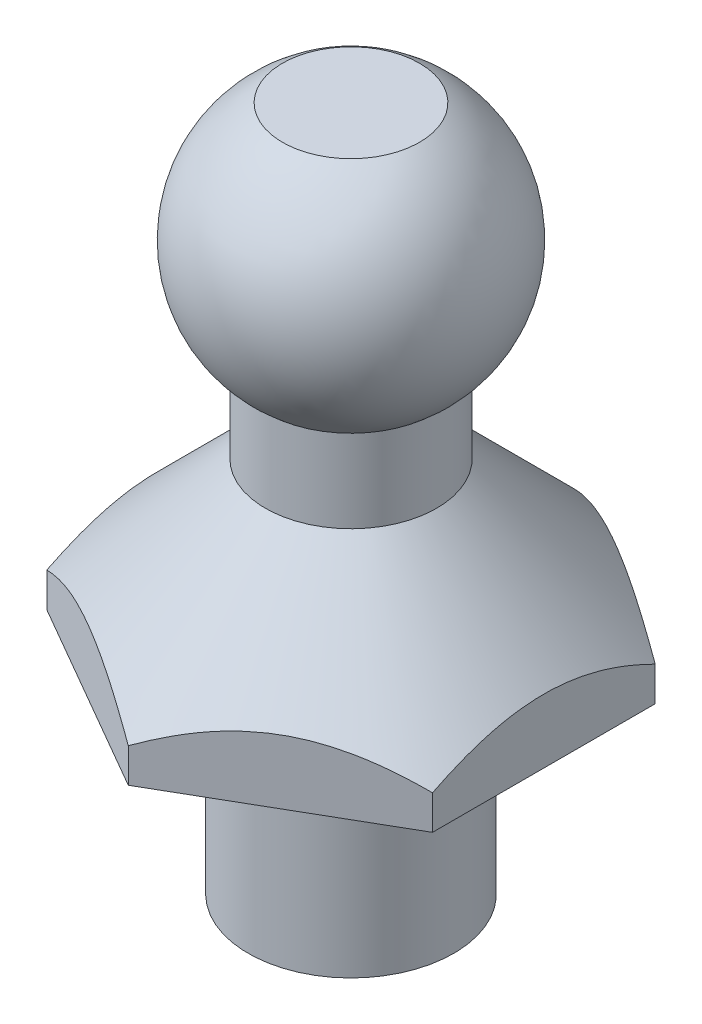
ISO-10303-21;
HEADER;
FILE_DESCRIPTION(('STEP AP214'),'2;1');
FILE_NAME('part.step','',(''),(''),'','','');
FILE_SCHEMA(('AUTOMOTIVE_DESIGN { 1 0 10303 214 1 1 1 1 }'));
ENDSEC;
DATA;
#1=APPLICATION_CONTEXT('core data for automotive mechanical design processes');
#2=APPLICATION_PROTOCOL_DEFINITION('international standard','automotive_design',2000,#1);
#3=PRODUCT_CONTEXT('',#1,'mechanical');
#4=PRODUCT('Part','Part','',(#3));
#5=PRODUCT_RELATED_PRODUCT_CATEGORY('part','',(#4));
#6=PRODUCT_DEFINITION_FORMATION('','',#4);
#7=PRODUCT_DEFINITION_CONTEXT('part definition',#1,'design');
#8=PRODUCT_DEFINITION('design','',#6,#7);
#9=PRODUCT_DEFINITION_SHAPE('','',#8);
#10=(LENGTH_UNIT() NAMED_UNIT(*) SI_UNIT(.MILLI.,.METRE.));
#11=(NAMED_UNIT(*) PLANE_ANGLE_UNIT() SI_UNIT($,.RADIAN.));
#12=(NAMED_UNIT(*) SI_UNIT($,.STERADIAN.) SOLID_ANGLE_UNIT());
#13=UNCERTAINTY_MEASURE_WITH_UNIT(LENGTH_MEASURE(1.E-05),#10,'distance_accuracy_value','');
#14=(GEOMETRIC_REPRESENTATION_CONTEXT(3) GLOBAL_UNCERTAINTY_ASSIGNED_CONTEXT((#13)) GLOBAL_UNIT_ASSIGNED_CONTEXT((#10,
#11,#12)) REPRESENTATION_CONTEXT('',''));
#15=CARTESIAN_POINT('',(0.,0.,0.));
#16=DIRECTION('',(0.,0.,1.));
#17=DIRECTION('',(1.,0.,0.));
#18=AXIS2_PLACEMENT_3D('',#15,#16,#17);
#19=CARTESIAN_POINT('',(0.,5.49999999999999,0.));
#20=DIRECTION('',(0.,-1.,0.));
#21=DIRECTION('',(0.,0.,-1.));
#22=AXIS2_PLACEMENT_3D('',#19,#20,#21);
#23=CONICAL_SURFACE('',#22,1.25,0.78539816339745);
#24=CARTESIAN_POINT('',(0.,5.49999999999999,0.));
#25=DIRECTION('',(0.,-1.,0.));
#26=DIRECTION('',(0.,0.,-1.));
#27=AXIS2_PLACEMENT_3D('',#24,#25,#26);
#28=CIRCLE('',#27,1.25);
#29=CARTESIAN_POINT('',(0.,5.49999999999999,-1.25));
#30=VERTEX_POINT('',#29);
#31=EDGE_CURVE('E135',#30,#30,#28,.T.);
#32=ORIENTED_EDGE('',*,*,#31,.T.);
#33=EDGE_LOOP('',(#32));
#34=FACE_BOUND('',#33,.T.);
#35=CARTESIAN_POINT('',(2.81478256229943,3.49988452379254,1.62488452994616));
#36=CARTESIAN_POINT('',(2.71803192840339,3.55569582125851,1.6807435344703));
#37=CARTESIAN_POINT('',(2.61966349999207,3.60822922894308,1.73753657309334));
#38=CARTESIAN_POINT('',(2.41907947271523,3.70441662600486,1.85334381523677));
#39=CARTESIAN_POINT('',(2.3168447981255,3.74801709742283,1.91236903213166));
#40=CARTESIAN_POINT('',(2.11069346128859,3.82270554280027,2.03139056194825));
#41=CARTESIAN_POINT('',(2.0068292995441,3.85398124190326,2.09135656369059));
#42=CARTESIAN_POINT('',(1.79681445265463,3.9021679296771,2.21260869207604));
#43=CARTESIAN_POINT('',(1.69067018302027,3.91911488792433,2.27389111472237));
#44=CARTESIAN_POINT('',(1.5077355925969,3.93440544734245,2.3795084497474));
#45=CARTESIAN_POINT('',(1.43118159824734,3.93666890950941,2.42370691899266));
#46=CARTESIAN_POINT('',(1.27819875489086,3.93285538424397,2.51203160478592));
#47=CARTESIAN_POINT('',(1.20176995915915,3.92677547287525,2.55615779057546));
#48=CARTESIAN_POINT('',(1.04963404318791,3.906621185951,2.64399350261487));
#49=CARTESIAN_POINT('',(0.973927826701759,3.89253786775703,2.68770250708247));
#50=CARTESIAN_POINT('',(0.823824540503675,3.8571498339076,2.77436467977518));
#51=CARTESIAN_POINT('',(0.749427370886975,3.83584567187425,2.81731790568033));
#52=CARTESIAN_POINT('',(0.558869296387395,3.7726013070244,2.92733666128892));
#53=CARTESIAN_POINT('',(0.443889803642777,3.7258944568754,2.99372010237631));
#54=CARTESIAN_POINT('',(0.274822400733115,3.64704715528485,3.0913312129574));
#55=CARTESIAN_POINT('',(0.219107121059345,3.61934388178491,3.12349844467502));
#56=CARTESIAN_POINT('',(0.108708552582559,3.56141201350278,3.18723708790324));
#57=CARTESIAN_POINT('',(0.0540246552704138,3.53118496874853,3.21880885073675));
#58=CARTESIAN_POINT('',(-0.000199999999999967,3.49988452379254,3.25011547005384));
#59=B_SPLINE_CURVE_WITH_KNOTS('',3,(#35,#36,#37,#38,#39,#40,#41,#42,#43,#44,#45,#46,#47,#48,#49,
#50,#51,#52,#53,#54,#55,#56,#57,#58),.UNSPECIFIED.,.F.,.F.,(4,2,2,2,2,2,2,2,2,2,2,4),(0.,
0.37490911686215,0.752002587144273,1.1231070809152,1.49327719799526,1.75817947462607,
2.0231746100049,2.28846642256626,2.55373789980351,2.97508242886091,3.18518339689877,
3.39515626298431),.UNSPECIFIED.);
#60=CARTESIAN_POINT('',(2.81458256229943,3.5,1.625));
#61=VERTEX_POINT('',#60);
#62=CARTESIAN_POINT('',(0.,3.5,3.25));
#63=VERTEX_POINT('',#62);
#64=EDGE_CURVE('E12',#61,#63,#59,.T.);
#65=ORIENTED_EDGE('',*,*,#64,.F.);
#66=CARTESIAN_POINT('',(2.81458256229943,2.51264677494492,-3.16753648027686));
#67=CARTESIAN_POINT('',(2.81458256229943,2.57054123027341,-3.09007080997921));
#68=CARTESIAN_POINT('',(2.81458256229943,2.62785431234928,-3.01216333514548));
#69=CARTESIAN_POINT('',(2.81458256229943,2.74106013780015,-2.85529371540969));
#70=CARTESIAN_POINT('',(2.81458256229943,2.79695251012891,-2.77633130304017));
#71=CARTESIAN_POINT('',(2.81458256229943,2.90745591854447,-2.61660370945998));
#72=CARTESIAN_POINT('',(2.81458256229943,2.96205365687216,-2.53582929667855));
#73=CARTESIAN_POINT('',(2.81458256229943,3.06913809562125,-2.37289728346604));
#74=CARTESIAN_POINT('',(2.81458256229943,3.12162494739351,-2.2907397828039));
#75=CARTESIAN_POINT('',(2.81458256229943,3.22679579443476,-2.12033702391546));
#76=CARTESIAN_POINT('',(2.81458256229943,3.27933665413556,-2.03200297047045));
#77=CARTESIAN_POINT('',(2.81458256229943,3.38085906326514,-1.85327985390826));
#78=CARTESIAN_POINT('',(2.81458256229943,3.42983999624399,-1.76289043841797));
#79=CARTESIAN_POINT('',(2.81458256229943,3.52317465721835,-1.58008984668445));
#80=CARTESIAN_POINT('',(2.81458256229943,3.56754230020514,-1.48768583125613));
#81=CARTESIAN_POINT('',(2.81458256229943,3.65066721883983,-1.30039444907879));
#82=CARTESIAN_POINT('',(2.81458256229943,3.68942628249785,-1.20550788520535));
#83=CARTESIAN_POINT('',(2.81458256229943,3.75746340028562,-1.01995509098646));
#84=CARTESIAN_POINT('',(2.81458256229943,3.78721838125317,-0.929465593053946));
#85=CARTESIAN_POINT('',(2.81458256229943,3.83945783931224,-0.746372174233533));
#86=CARTESIAN_POINT('',(2.81458256229943,3.86194179433601,-0.653768102027701));
#87=CARTESIAN_POINT('',(2.81458256229943,3.89811115527726,-0.468504136095879));
#88=CARTESIAN_POINT('',(2.81458256229943,3.91194293678274,-0.375873286506929));
#89=CARTESIAN_POINT('',(2.81458256229943,3.9305509613811,-0.189701903234011));
#90=CARTESIAN_POINT('',(2.81458256229943,3.93532861799637,-0.0961615138389461));
#91=CARTESIAN_POINT('',(2.81458256229943,3.93550094302556,0.0878509959341532));
#92=CARTESIAN_POINT('',(2.81458256229943,3.93119870494715,0.178322961294924));
#93=CARTESIAN_POINT('',(2.81458256229943,3.91410137130974,0.358455604496339));
#94=CARTESIAN_POINT('',(2.81458256229943,3.90130542817826,0.448116200466636));
#95=CARTESIAN_POINT('',(2.81458256229943,3.86768849398834,0.627492078676932));
#96=CARTESIAN_POINT('',(2.81458256229943,3.84673340989135,0.71718183709899));
#97=CARTESIAN_POINT('',(2.81458256229943,3.79789377205659,0.894615557814927));
#98=CARTESIAN_POINT('',(2.81458256229943,3.77000988531894,0.982359706517548));
#99=CARTESIAN_POINT('',(2.81458256229943,3.70495314029016,1.16558254819238));
#100=CARTESIAN_POINT('',(2.81458256229943,3.66708607829135,1.26081240499303));
#101=CARTESIAN_POINT('',(2.81458256229943,3.58556742398726,1.44877026883071));
#102=CARTESIAN_POINT('',(2.81458256229943,3.5419138456288,1.54149740366992));
#103=CARTESIAN_POINT('',(2.81458256229943,3.449855682529,1.72493244319764));
#104=CARTESIAN_POINT('',(2.81458256229943,3.4014356818424,1.81563254877077));
#105=CARTESIAN_POINT('',(2.81458256229943,3.300921480241,1.99493803227013));
#106=CARTESIAN_POINT('',(2.81458256229943,3.24882795092564,2.08354378915348));
#107=CARTESIAN_POINT('',(2.81458256229943,3.144373293122,2.25455497118408));
#108=CARTESIAN_POINT('',(2.81458256229943,3.09215606651896,2.33704875841452));
#109=CARTESIAN_POINT('',(2.81458256229943,2.98554318422816,2.50062097121678));
#110=CARTESIAN_POINT('',(2.81458256229943,2.93114736265696,2.5816992883338));
#111=CARTESIAN_POINT('',(2.81458256229943,2.82102043138256,2.74196524042833));
#112=CARTESIAN_POINT('',(2.81458256229943,2.76530387989422,2.82116291497638));
#113=CARTESIAN_POINT('',(2.81458256229943,2.65241034483571,2.97847874431147));
#114=CARTESIAN_POINT('',(2.81458256229943,2.59523376625015,3.05659718938805));
#115=CARTESIAN_POINT('',(2.81458256229943,2.5374607194109,3.1342642183623));
#116=B_SPLINE_CURVE_WITH_KNOTS('',3,(#66,#67,#68,#69,#70,#71,#72,#73,#74,#75,#76,#77,#78,#79,
#80,#81,#82,#83,#84,#85,#86,#87,#88,#89,#90,#91,#92,#93,#94,#95,#96,#97,#98,#99,#100,#101,#102,
#103,#104,#105,#106,#107,#108,#109,#110,#111,#112,#113,#114,#115),.UNSPECIFIED.,.F.,.F.,(4,2,2,
2,2,2,2,2,2,2,2,2,2,2,2,2,2,2,2,2,2,2,2,2,4),(0.,0.290133996791204,0.580343005007957,
0.872802533812616,1.16524105570942,1.47351020690384,1.7818326125537,2.08919626874498,
2.39646172077157,2.68197611864997,2.96751101223076,3.24807446129522,3.52859410541964,
3.79989812178864,4.07122921519798,4.3472217577803,4.62318774226909,4.93039334925607,
5.23770466995732,5.54604479268778,5.85432868968009,6.14718218331588,6.44005801807253,
6.73053868093105,7.02093962677184),.UNSPECIFIED.);
#117=CARTESIAN_POINT('',(2.81458256229943,3.5,-1.625));
#118=VERTEX_POINT('',#117);
#119=EDGE_CURVE('E50',#118,#61,#116,.T.);
#120=ORIENTED_EDGE('',*,*,#119,.F.);
#121=CARTESIAN_POINT('',(-0.000199999999999566,3.49988452379254,-3.25011547005384));
#122=CARTESIAN_POINT('',(0.0965506338960343,3.55569582125851,-3.19425646552969));
#123=CARTESIAN_POINT('',(0.194919062307356,3.60822922894308,-3.13746342690666));
#124=CARTESIAN_POINT('',(0.3955030895842,3.70441662600486,-3.02165618476323));
#125=CARTESIAN_POINT('',(0.497737764173927,3.74801709742283,-2.96263096786834));
#126=CARTESIAN_POINT('',(0.703889101010832,3.82270554280027,-2.84360943805175));
#127=CARTESIAN_POINT('',(0.807753262755328,3.85398124190326,-2.78364343630941));
#128=CARTESIAN_POINT('',(1.0177681096448,3.9021679296771,-2.66239130792396));
#129=CARTESIAN_POINT('',(1.12391237927916,3.91911488792433,-2.60110888527763));
#130=CARTESIAN_POINT('',(1.30684696970252,3.93440544734245,-2.4954915502526));
#131=CARTESIAN_POINT('',(1.38340096405209,3.93666890950941,-2.45129308100734));
#132=CARTESIAN_POINT('',(1.53638380740857,3.93285538424397,-2.36296839521408));
#133=CARTESIAN_POINT('',(1.61281260314028,3.92677547287525,-2.31884220942454));
#134=CARTESIAN_POINT('',(1.76494851911152,3.906621185951,-2.23100649738513));
#135=CARTESIAN_POINT('',(1.84065473559767,3.89253786775703,-2.18729749291753));
#136=CARTESIAN_POINT('',(1.99075802179575,3.8571498339076,-2.10063532022482));
#137=CARTESIAN_POINT('',(2.06515519141245,3.83584567187425,-2.05768209431967));
#138=CARTESIAN_POINT('',(2.25571326591203,3.77260130702439,-1.94766333871108));
#139=CARTESIAN_POINT('',(2.37069275865665,3.7258944568754,-1.88127989762369));
#140=CARTESIAN_POINT('',(2.53976016156631,3.64704715528485,-1.7836687870426));
#141=CARTESIAN_POINT('',(2.59547544124008,3.61934388178491,-1.75150155532498));
#142=CARTESIAN_POINT('',(2.70587400971687,3.56141201350278,-1.68776291209676));
#143=CARTESIAN_POINT('',(2.76055790702901,3.53118496874853,-1.65619114926325));
#144=CARTESIAN_POINT('',(2.81478256229943,3.49988452379254,-1.62488452994616));
#145=B_SPLINE_CURVE_WITH_KNOTS('',3,(#121,#122,#123,#124,#125,#126,#127,#128,#129,#130,#131,
#132,#133,#134,#135,#136,#137,#138,#139,#140,#141,#142,#143,#144),.UNSPECIFIED.,.F.,.F.,(4,2,2,
2,2,2,2,2,2,2,2,4),(0.,0.374909116862151,0.752002587144274,1.1231070809152,1.49327719799526,
1.75817947462607,2.02317461000491,2.28846642256627,2.55373789980351,2.97508242886091,
3.18518339689877,3.39515626298431),.UNSPECIFIED.);
#146=CARTESIAN_POINT('',(0.,3.5,-3.25));
#147=VERTEX_POINT('',#146);
#148=EDGE_CURVE('E198',#147,#118,#145,.T.);
#149=ORIENTED_EDGE('',*,*,#148,.F.);
#150=CARTESIAN_POINT('',(-2.81478256229943,3.49988452379254,-1.62488452994616));
#151=CARTESIAN_POINT('',(-2.71803192840339,3.55569582125851,-1.6807435344703));
#152=CARTESIAN_POINT('',(-2.61966349999207,3.60822922894308,-1.73753657309334));
#153=CARTESIAN_POINT('',(-2.41907947271523,3.70441662600486,-1.85334381523677));
#154=CARTESIAN_POINT('',(-2.3168447981255,3.74801709742283,-1.91236903213166));
#155=CARTESIAN_POINT('',(-2.11069346128859,3.82270554280027,-2.03139056194825));
#156=CARTESIAN_POINT('',(-2.0068292995441,3.85398124190326,-2.09135656369059));
#157=CARTESIAN_POINT('',(-1.79681445265463,3.9021679296771,-2.21260869207604));
#158=CARTESIAN_POINT('',(-1.69067018302027,3.91911488792433,-2.27389111472237));
#159=CARTESIAN_POINT('',(-1.5077355925969,3.93440544734245,-2.3795084497474));
#160=CARTESIAN_POINT('',(-1.43118159824734,3.93666890950941,-2.42370691899266));
#161=CARTESIAN_POINT('',(-1.27819875489085,3.93285538424397,-2.51203160478592));
#162=CARTESIAN_POINT('',(-1.20176995915915,3.92677547287525,-2.55615779057546));
#163=CARTESIAN_POINT('',(-1.04963404318791,3.906621185951,-2.64399350261487));
#164=CARTESIAN_POINT('',(-0.973927826701757,3.89253786775703,-2.68770250708247));
#165=CARTESIAN_POINT('',(-0.823824540503674,3.8571498339076,-2.77436467977518));
#166=CARTESIAN_POINT('',(-0.749427370886974,3.83584567187425,-2.81731790568033));
#167=CARTESIAN_POINT('',(-0.558869296387394,3.7726013070244,-2.92733666128892));
#168=CARTESIAN_POINT('',(-0.443889803642776,3.7258944568754,-2.99372010237631));
#169=CARTESIAN_POINT('',(-0.274822400733115,3.64704715528485,-3.0913312129574));
#170=CARTESIAN_POINT('',(-0.219107121059344,3.61934388178491,-3.12349844467502));
#171=CARTESIAN_POINT('',(-0.108708552582559,3.56141201350278,-3.18723708790324));
#172=CARTESIAN_POINT('',(-0.0540246552704132,3.53118496874853,-3.21880885073675));
#173=CARTESIAN_POINT('',(0.000200000000000729,3.49988452379254,-3.25011547005384));
#174=B_SPLINE_CURVE_WITH_KNOTS('',3,(#150,#151,#152,#153,#154,#155,#156,#157,#158,#159,#160,
#161,#162,#163,#164,#165,#166,#167,#168,#169,#170,#171,#172,#173),.UNSPECIFIED.,.F.,.F.,(4,2,2,
2,2,2,2,2,2,2,2,4),(0.,0.374909116862151,0.752002587144274,1.1231070809152,1.49327719799526,
1.75817947462607,2.02317461000491,2.28846642256627,2.55373789980351,2.97508242886091,
3.18518339689877,3.39515626298432),.UNSPECIFIED.);
#175=CARTESIAN_POINT('',(-2.81458256229943,3.5,-1.625));
#176=VERTEX_POINT('',#175);
#177=EDGE_CURVE('E199',#176,#147,#174,.T.);
#178=ORIENTED_EDGE('',*,*,#177,.F.);
#179=CARTESIAN_POINT('',(-2.81458256229943,2.51264677494493,-3.16753648027685));
#180=CARTESIAN_POINT('',(-2.81458256229943,2.57054123027342,-3.09007080997921));
#181=CARTESIAN_POINT('',(-2.81458256229943,2.62785431234928,-3.01216333514548));
#182=CARTESIAN_POINT('',(-2.81458256229943,2.74106013780015,-2.85529371540969));
#183=CARTESIAN_POINT('',(-2.81458256229943,2.79695251012891,-2.77633130304016));
#184=CARTESIAN_POINT('',(-2.81458256229943,2.90745591854447,-2.61660370945998));
#185=CARTESIAN_POINT('',(-2.81458256229943,2.96205365687216,-2.53582929667855));
#186=CARTESIAN_POINT('',(-2.81458256229943,3.06913809562125,-2.37289728346604));
#187=CARTESIAN_POINT('',(-2.81458256229943,3.12162494739351,-2.29073978280389));
#188=CARTESIAN_POINT('',(-2.81458256229943,3.22679579443476,-2.12033702391546));
#189=CARTESIAN_POINT('',(-2.81458256229943,3.27933665413556,-2.03200297047045));
#190=CARTESIAN_POINT('',(-2.81458256229943,3.38085906326514,-1.85327985390825));
#191=CARTESIAN_POINT('',(-2.81458256229943,3.42983999624399,-1.76289043841797));
#192=CARTESIAN_POINT('',(-2.81458256229943,3.52317465721835,-1.58008984668445));
#193=CARTESIAN_POINT('',(-2.81458256229943,3.56754230020514,-1.48768583125613));
#194=CARTESIAN_POINT('',(-2.81458256229943,3.65066721883983,-1.30039444907879));
#195=CARTESIAN_POINT('',(-2.81458256229943,3.68942628249785,-1.20550788520535));
#196=CARTESIAN_POINT('',(-2.81458256229943,3.75746340028562,-1.01995509098646));
#197=CARTESIAN_POINT('',(-2.81458256229943,3.78721838125317,-0.929465593053946));
#198=CARTESIAN_POINT('',(-2.81458256229943,3.83945783931224,-0.746372174233533));
#199=CARTESIAN_POINT('',(-2.81458256229943,3.86194179433601,-0.6537681020277));
#200=CARTESIAN_POINT('',(-2.81458256229943,3.89811115527726,-0.468504136095878));
#201=CARTESIAN_POINT('',(-2.81458256229943,3.91194293678274,-0.375873286506927));
#202=CARTESIAN_POINT('',(-2.81458256229943,3.9305509613811,-0.189701903234009));
#203=CARTESIAN_POINT('',(-2.81458256229943,3.93532861799637,-0.0961615138389451));
#204=CARTESIAN_POINT('',(-2.81458256229943,3.93550094302556,0.0878509959341541));
#205=CARTESIAN_POINT('',(-2.81458256229943,3.93119870494715,0.178322961294925));
#206=CARTESIAN_POINT('',(-2.81458256229943,3.91410137130974,0.35845560449634));
#207=CARTESIAN_POINT('',(-2.81458256229943,3.90130542817826,0.448116200466636));
#208=CARTESIAN_POINT('',(-2.81458256229943,3.86768849398834,0.627492078676933));
#209=CARTESIAN_POINT('',(-2.81458256229943,3.84673340989135,0.717181837098991));
#210=CARTESIAN_POINT('',(-2.81458256229943,3.79789377205659,0.894615557814928));
#211=CARTESIAN_POINT('',(-2.81458256229943,3.77000988531894,0.982359706517549));
#212=CARTESIAN_POINT('',(-2.81458256229943,3.70495314029016,1.16558254819238));
#213=CARTESIAN_POINT('',(-2.81458256229943,3.66708607829135,1.26081240499303));
#214=CARTESIAN_POINT('',(-2.81458256229943,3.58556742398725,1.44877026883071));
#215=CARTESIAN_POINT('',(-2.81458256229943,3.5419138456288,1.54149740366992));
#216=CARTESIAN_POINT('',(-2.81458256229943,3.44985568252899,1.72493244319764));
#217=CARTESIAN_POINT('',(-2.81458256229943,3.4014356818424,1.81563254877077));
#218=CARTESIAN_POINT('',(-2.81458256229943,3.300921480241,1.99493803227013));
#219=CARTESIAN_POINT('',(-2.81458256229943,3.24882795092564,2.08354378915348));
#220=CARTESIAN_POINT('',(-2.81458256229943,3.144373293122,2.25455497118408));
#221=CARTESIAN_POINT('',(-2.81458256229943,3.09215606651895,2.33704875841452));
#222=CARTESIAN_POINT('',(-2.81458256229943,2.98554318422816,2.50062097121678));
#223=CARTESIAN_POINT('',(-2.81458256229943,2.93114736265696,2.5816992883338));
#224=CARTESIAN_POINT('',(-2.81458256229943,2.82102043138256,2.74196524042833));
#225=CARTESIAN_POINT('',(-2.81458256229943,2.76530387989421,2.82116291497638));
#226=CARTESIAN_POINT('',(-2.81458256229943,2.65241034483571,2.97847874431147));
#227=CARTESIAN_POINT('',(-2.81458256229943,2.59523376625015,3.05659718938805));
#228=CARTESIAN_POINT('',(-2.81458256229943,2.53746071941089,3.1342642183623));
#229=B_SPLINE_CURVE_WITH_KNOTS('',3,(#179,#180,#181,#182,#183,#184,#185,#186,#187,#188,#189,
#190,#191,#192,#193,#194,#195,#196,#197,#198,#199,#200,#201,#202,#203,#204,#205,#206,#207,#208,
#209,#210,#211,#212,#213,#214,#215,#216,#217,#218,#219,#220,#221,#222,#223,#224,#225,#226,#227,
#228),.UNSPECIFIED.,.F.,.F.,(4,2,2,2,2,2,2,2,2,2,2,2,2,2,2,2,2,2,2,2,2,2,2,2,4),(0.,
0.290133996791204,0.580343005007957,0.872802533812615,1.16524105570942,1.47351020690384,
1.7818326125537,2.08919626874498,2.39646172077157,2.68197611864997,2.96751101223076,
3.24807446129522,3.52859410541964,3.79989812178864,4.07122921519798,4.3472217577803,
4.62318774226909,4.93039334925607,5.23770466995732,5.54604479268778,5.85432868968008,
6.14718218331588,6.44005801807253,6.73053868093105,7.02093962677184),.UNSPECIFIED.);
#230=CARTESIAN_POINT('',(-2.81458256229943,3.5,1.625));
#231=VERTEX_POINT('',#230);
#232=EDGE_CURVE('E97',#231,#176,#229,.F.);
#233=ORIENTED_EDGE('',*,*,#232,.F.);
#234=CARTESIAN_POINT('',(0.00019999999999993,3.49988452379254,3.25011547005384));
#235=CARTESIAN_POINT('',(-0.0965506338960341,3.55569582125851,3.1942564655297));
#236=CARTESIAN_POINT('',(-0.194919062307356,3.60822922894308,3.13746342690666));
#237=CARTESIAN_POINT('',(-0.3955030895842,3.70441662600486,3.02165618476323));
#238=CARTESIAN_POINT('',(-0.497737764173926,3.74801709742283,2.96263096786834));
#239=CARTESIAN_POINT('',(-0.703889101010831,3.82270554280027,2.84360943805175));
#240=CARTESIAN_POINT('',(-0.807753262755327,3.85398124190326,2.78364343630941));
#241=CARTESIAN_POINT('',(-1.0177681096448,3.9021679296771,2.66239130792396));
#242=CARTESIAN_POINT('',(-1.12391237927916,3.91911488792433,2.60110888527763));
#243=CARTESIAN_POINT('',(-1.30684696970252,3.93440544734245,2.4954915502526));
#244=CARTESIAN_POINT('',(-1.38340096405209,3.93666890950941,2.45129308100734));
#245=CARTESIAN_POINT('',(-1.53638380740857,3.93285538424397,2.36296839521408));
#246=CARTESIAN_POINT('',(-1.61281260314028,3.92677547287525,2.31884220942454));
#247=CARTESIAN_POINT('',(-1.76494851911152,3.906621185951,2.23100649738513));
#248=CARTESIAN_POINT('',(-1.84065473559767,3.89253786775703,2.18729749291753));
#249=CARTESIAN_POINT('',(-1.99075802179575,3.8571498339076,2.10063532022482));
#250=CARTESIAN_POINT('',(-2.06515519141245,3.83584567187425,2.05768209431967));
#251=CARTESIAN_POINT('',(-2.25571326591203,3.77260130702439,1.94766333871108));
#252=CARTESIAN_POINT('',(-2.37069275865665,3.7258944568754,1.88127989762369));
#253=CARTESIAN_POINT('',(-2.53976016156631,3.64704715528485,1.7836687870426));
#254=CARTESIAN_POINT('',(-2.59547544124008,3.61934388178491,1.75150155532498));
#255=CARTESIAN_POINT('',(-2.70587400971687,3.56141201350278,1.68776291209675));
#256=CARTESIAN_POINT('',(-2.76055790702901,3.53118496874853,1.65619114926325));
#257=CARTESIAN_POINT('',(-2.81478256229943,3.49988452379253,1.62488452994616));
#258=B_SPLINE_CURVE_WITH_KNOTS('',3,(#234,#235,#236,#237,#238,#239,#240,#241,#242,#243,#244,
#245,#246,#247,#248,#249,#250,#251,#252,#253,#254,#255,#256,#257),.UNSPECIFIED.,.F.,.F.,(4,2,2,
2,2,2,2,2,2,2,2,4),(0.,0.374909116862151,0.752002587144274,1.1231070809152,1.49327719799526,
1.75817947462607,2.02317461000491,2.28846642256626,2.55373789980351,2.97508242886091,
3.18518339689877,3.39515626298432),.UNSPECIFIED.);
#259=EDGE_CURVE('E147',#63,#231,#258,.T.);
#260=ORIENTED_EDGE('',*,*,#259,.F.);
#261=EDGE_LOOP('',(#65,#120,#149,#178,#233,#260));
#262=FACE_BOUND('',#261,.T.);
#263=ADVANCED_FACE('F37',(#34,#262),#23,.T.);
#264=CARTESIAN_POINT('',(0.,8.26794919243111,0.));
#265=DIRECTION('',(0.,-1.,0.));
#266=DIRECTION('',(1.,0.,0.));
#267=AXIS2_PLACEMENT_3D('',#264,#265,#266);
#268=SPHERICAL_SURFACE('',#267,2.);
#269=CARTESIAN_POINT('',(0.,6.70669969283151,0.));
#270=DIRECTION('',(0.,-1.,0.));
#271=DIRECTION('',(0.,0.,-1.));
#272=AXIS2_PLACEMENT_3D('',#269,#270,#271);
#273=CIRCLE('',#272,1.25);
#274=CARTESIAN_POINT('',(0.,6.70669969283151,-1.25));
#275=VERTEX_POINT('',#274);
#276=EDGE_CURVE('E127',#275,#275,#273,.T.);
#277=ORIENTED_EDGE('',*,*,#276,.F.);
#278=EDGE_LOOP('',(#277));
#279=FACE_BOUND('',#278,.T.);
#280=CARTESIAN_POINT('',(0.,9.99999999999999,0.));
#281=DIRECTION('',(0.,-1.,0.));
#282=DIRECTION('',(0.,0.,-1.));
#283=AXIS2_PLACEMENT_3D('',#280,#281,#282);
#284=CIRCLE('',#283,1.);
#285=CARTESIAN_POINT('',(0.,9.99999999999999,-1.));
#286=VERTEX_POINT('',#285);
#287=EDGE_CURVE('E144',#286,#286,#284,.T.);
#288=ORIENTED_EDGE('',*,*,#287,.T.);
#289=EDGE_LOOP('',(#288));
#290=FACE_BOUND('',#289,.T.);
#291=ADVANCED_FACE('F39',(#279,#290),#268,.T.);
#292=CARTESIAN_POINT('',(0.,9.99999999999999,0.));
#293=DIRECTION('',(0.,-1.,0.));
#294=DIRECTION('',(0.,0.,-1.));
#295=AXIS2_PLACEMENT_3D('',#292,#293,#294);
#296=PLANE('',#295);
#297=ORIENTED_EDGE('',*,*,#287,.F.);
#298=EDGE_LOOP('',(#297));
#299=FACE_BOUND('',#298,.T.);
#300=ADVANCED_FACE('F174',(#299),#296,.F.);
#301=CARTESIAN_POINT('',(0.,5.49999999999999,0.));
#302=DIRECTION('',(0.,-1.,0.));
#303=DIRECTION('',(0.,0.,-1.));
#304=AXIS2_PLACEMENT_3D('',#301,#302,#303);
#305=CYLINDRICAL_SURFACE('',#304,1.25);
#306=ORIENTED_EDGE('',*,*,#276,.T.);
#307=EDGE_LOOP('',(#306));
#308=FACE_BOUND('',#307,.T.);
#309=ORIENTED_EDGE('',*,*,#31,.F.);
#310=EDGE_LOOP('',(#309));
#311=FACE_BOUND('',#310,.T.);
#312=ADVANCED_FACE('F171',(#308,#311),#305,.T.);
#313=CARTESIAN_POINT('',(2.81458256229943,9.99999999999999,1.625));
#314=DIRECTION('',(0.5,0.,0.866025403784439));
#315=DIRECTION('',(0.866025403784439,0.,-0.5));
#316=AXIS2_PLACEMENT_3D('',#313,#314,#315);
#317=PLANE('',#316);
#318=ORIENTED_EDGE('',*,*,#64,.T.);
#319=DIRECTION('',(0.,-1.,0.));
#320=VECTOR('',#319,1.);
#321=CARTESIAN_POINT('',(0.,9.99999999999999,3.25));
#322=LINE('',#321,#320);
#323=CARTESIAN_POINT('',(0.,3.,3.25));
#324=VERTEX_POINT('',#323);
#325=EDGE_CURVE('E65',#63,#324,#322,.T.);
#326=ORIENTED_EDGE('',*,*,#325,.T.);
#327=DIRECTION('',(-0.866025403784439,0.,0.5));
#328=VECTOR('',#327,1.);
#329=CARTESIAN_POINT('',(2.81458256229943,3.,1.625));
#330=LINE('',#329,#328);
#331=CARTESIAN_POINT('',(2.81458256229943,3.,1.625));
#332=VERTEX_POINT('',#331);
#333=EDGE_CURVE('E117',#332,#324,#330,.T.);
#334=ORIENTED_EDGE('',*,*,#333,.F.);
#335=DIRECTION('',(0.,-1.,0.));
#336=VECTOR('',#335,1.);
#337=CARTESIAN_POINT('',(2.81458256229943,9.99999999999999,1.625));
#338=LINE('',#337,#336);
#339=EDGE_CURVE('E125',#61,#332,#338,.T.);
#340=ORIENTED_EDGE('',*,*,#339,.F.);
#341=EDGE_LOOP('',(#318,#326,#334,#340));
#342=FACE_BOUND('',#341,.T.);
#343=ADVANCED_FACE('F167',(#342),#317,.T.);
#344=CARTESIAN_POINT('',(2.81458256229943,9.99999999999999,-1.625));
#345=DIRECTION('',(1.,0.,0.));
#346=DIRECTION('',(0.,0.,-1.));
#347=AXIS2_PLACEMENT_3D('',#344,#345,#346);
#348=PLANE('',#347);
#349=ORIENTED_EDGE('',*,*,#119,.T.);
#350=ORIENTED_EDGE('',*,*,#339,.T.);
#351=DIRECTION('',(0.,0.,1.));
#352=VECTOR('',#351,1.);
#353=CARTESIAN_POINT('',(2.81458256229943,3.,-1.625));
#354=LINE('',#353,#352);
#355=CARTESIAN_POINT('',(2.81458256229943,3.,-1.625));
#356=VERTEX_POINT('',#355);
#357=EDGE_CURVE('E122',#356,#332,#354,.T.);
#358=ORIENTED_EDGE('',*,*,#357,.F.);
#359=DIRECTION('',(0.,-1.,0.));
#360=VECTOR('',#359,1.);
#361=CARTESIAN_POINT('',(2.81458256229943,9.99999999999999,-1.625));
#362=LINE('',#361,#360);
#363=EDGE_CURVE('E128',#118,#356,#362,.T.);
#364=ORIENTED_EDGE('',*,*,#363,.F.);
#365=EDGE_LOOP('',(#349,#350,#358,#364));
#366=FACE_BOUND('',#365,.T.);
#367=ADVANCED_FACE('F170',(#366),#348,.T.);
#368=CARTESIAN_POINT('',(0.,9.99999999999999,-3.25));
#369=DIRECTION('',(0.5,0.,-0.866025403784439));
#370=DIRECTION('',(-0.866025403784439,0.,-0.5));
#371=AXIS2_PLACEMENT_3D('',#368,#369,#370);
#372=PLANE('',#371);
#373=ORIENTED_EDGE('',*,*,#148,.T.);
#374=ORIENTED_EDGE('',*,*,#363,.T.);
#375=DIRECTION('',(0.866025403784439,0.,0.5));
#376=VECTOR('',#375,1.);
#377=CARTESIAN_POINT('',(0.,3.,-3.25));
#378=LINE('',#377,#376);
#379=CARTESIAN_POINT('',(0.,3.,-3.25));
#380=VERTEX_POINT('',#379);
#381=EDGE_CURVE('E110',#380,#356,#378,.T.);
#382=ORIENTED_EDGE('',*,*,#381,.F.);
#383=DIRECTION('',(0.,-1.,0.));
#384=VECTOR('',#383,1.);
#385=CARTESIAN_POINT('',(0.,9.99999999999999,-3.25));
#386=LINE('',#385,#384);
#387=EDGE_CURVE('E100',#147,#380,#386,.T.);
#388=ORIENTED_EDGE('',*,*,#387,.F.);
#389=EDGE_LOOP('',(#373,#374,#382,#388));
#390=FACE_BOUND('',#389,.T.);
#391=ADVANCED_FACE('F211',(#390),#372,.T.);
#392=CARTESIAN_POINT('',(-2.81458256229943,9.99999999999999,-1.625));
#393=DIRECTION('',(-0.5,0.,-0.866025403784439));
#394=DIRECTION('',(-0.866025403784439,0.,0.5));
#395=AXIS2_PLACEMENT_3D('',#392,#393,#394);
#396=PLANE('',#395);
#397=ORIENTED_EDGE('',*,*,#177,.T.);
#398=ORIENTED_EDGE('',*,*,#387,.T.);
#399=DIRECTION('',(0.866025403784439,0.,-0.5));
#400=VECTOR('',#399,1.);
#401=CARTESIAN_POINT('',(-2.81458256229943,3.,-1.625));
#402=LINE('',#401,#400);
#403=CARTESIAN_POINT('',(-2.81458256229943,3.,-1.625));
#404=VERTEX_POINT('',#403);
#405=EDGE_CURVE('E104',#404,#380,#402,.T.);
#406=ORIENTED_EDGE('',*,*,#405,.F.);
#407=DIRECTION('',(0.,-1.,0.));
#408=VECTOR('',#407,1.);
#409=CARTESIAN_POINT('',(-2.81458256229943,9.99999999999999,-1.625));
#410=LINE('',#409,#408);
#411=EDGE_CURVE('E93',#176,#404,#410,.T.);
#412=ORIENTED_EDGE('',*,*,#411,.F.);
#413=EDGE_LOOP('',(#397,#398,#406,#412));
#414=FACE_BOUND('',#413,.T.);
#415=ADVANCED_FACE('F105',(#414),#396,.T.);
#416=CARTESIAN_POINT('',(-2.81458256229943,9.99999999999999,1.625));
#417=DIRECTION('',(-1.,0.,0.));
#418=DIRECTION('',(0.,0.,1.));
#419=AXIS2_PLACEMENT_3D('',#416,#417,#418);
#420=PLANE('',#419);
#421=ORIENTED_EDGE('',*,*,#232,.T.);
#422=ORIENTED_EDGE('',*,*,#411,.T.);
#423=DIRECTION('',(0.,0.,-1.));
#424=VECTOR('',#423,1.);
#425=CARTESIAN_POINT('',(-2.81458256229943,3.,1.625));
#426=LINE('',#425,#424);
#427=CARTESIAN_POINT('',(-2.81458256229943,3.,1.625));
#428=VERTEX_POINT('',#427);
#429=EDGE_CURVE('E57',#428,#404,#426,.T.);
#430=ORIENTED_EDGE('',*,*,#429,.F.);
#431=DIRECTION('',(0.,-1.,0.));
#432=VECTOR('',#431,1.);
#433=CARTESIAN_POINT('',(-2.81458256229943,9.99999999999999,1.625));
#434=LINE('',#433,#432);
#435=EDGE_CURVE('E101',#231,#428,#434,.T.);
#436=ORIENTED_EDGE('',*,*,#435,.F.);
#437=EDGE_LOOP('',(#421,#422,#430,#436));
#438=FACE_BOUND('',#437,.T.);
#439=ADVANCED_FACE('F95',(#438),#420,.T.);
#440=CARTESIAN_POINT('',(0.,9.99999999999999,3.25));
#441=DIRECTION('',(-0.5,0.,0.866025403784439));
#442=DIRECTION('',(0.866025403784439,0.,0.5));
#443=AXIS2_PLACEMENT_3D('',#440,#441,#442);
#444=PLANE('',#443);
#445=ORIENTED_EDGE('',*,*,#259,.T.);
#446=ORIENTED_EDGE('',*,*,#435,.T.);
#447=DIRECTION('',(-0.866025403784439,0.,-0.5));
#448=VECTOR('',#447,1.);
#449=CARTESIAN_POINT('',(0.,3.,3.25));
#450=LINE('',#449,#448);
#451=EDGE_CURVE('E115',#324,#428,#450,.T.);
#452=ORIENTED_EDGE('',*,*,#451,.F.);
#453=ORIENTED_EDGE('',*,*,#325,.F.);
#454=EDGE_LOOP('',(#445,#446,#452,#453));
#455=FACE_BOUND('',#454,.T.);
#456=ADVANCED_FACE('F161',(#455),#444,.T.);
#457=CARTESIAN_POINT('',(0.,0.,0.));
#458=DIRECTION('',(0.,1.,0.));
#459=DIRECTION('',(0.,0.,1.));
#460=AXIS2_PLACEMENT_3D('',#457,#458,#459);
#461=PLANE('',#460);
#462=CARTESIAN_POINT('',(0.,0.,0.));
#463=DIRECTION('',(0.,-1.,0.));
#464=DIRECTION('',(0.,0.,-1.));
#465=AXIS2_PLACEMENT_3D('',#462,#463,#464);
#466=CIRCLE('',#465,1.5);
#467=CARTESIAN_POINT('',(0.,0.,-1.5));
#468=VERTEX_POINT('',#467);
#469=EDGE_CURVE('E141',#468,#468,#466,.T.);
#470=ORIENTED_EDGE('',*,*,#469,.T.);
#471=EDGE_LOOP('',(#470));
#472=FACE_BOUND('',#471,.T.);
#473=ADVANCED_FACE('F164',(#472),#461,.F.);
#474=CARTESIAN_POINT('',(0.,5.49999999999999,0.));
#475=DIRECTION('',(0.,-1.,0.));
#476=DIRECTION('',(0.,0.,-1.));
#477=AXIS2_PLACEMENT_3D('',#474,#475,#476);
#478=CYLINDRICAL_SURFACE('',#477,1.5);
#479=ORIENTED_EDGE('',*,*,#469,.F.);
#480=EDGE_LOOP('',(#479));
#481=FACE_BOUND('',#480,.T.);
#482=CARTESIAN_POINT('',(0.,3.,0.));
#483=DIRECTION('',(0.,-1.,0.));
#484=DIRECTION('',(0.,0.,-1.));
#485=AXIS2_PLACEMENT_3D('',#482,#483,#484);
#486=CIRCLE('',#485,1.5);
#487=CARTESIAN_POINT('',(0.,3.,-1.5));
#488=VERTEX_POINT('',#487);
#489=EDGE_CURVE('E138',#488,#488,#486,.T.);
#490=ORIENTED_EDGE('',*,*,#489,.T.);
#491=EDGE_LOOP('',(#490));
#492=FACE_BOUND('',#491,.T.);
#493=ADVANCED_FACE('F236',(#481,#492),#478,.T.);
#494=CARTESIAN_POINT('',(0.,3.,0.));
#495=DIRECTION('',(0.,1.,0.));
#496=DIRECTION('',(0.,0.,1.));
#497=AXIS2_PLACEMENT_3D('',#494,#495,#496);
#498=PLANE('',#497);
#499=ORIENTED_EDGE('',*,*,#489,.F.);
#500=EDGE_LOOP('',(#499));
#501=FACE_BOUND('',#500,.T.);
#502=ORIENTED_EDGE('',*,*,#333,.T.);
#503=ORIENTED_EDGE('',*,*,#451,.T.);
#504=ORIENTED_EDGE('',*,*,#429,.T.);
#505=ORIENTED_EDGE('',*,*,#405,.T.);
#506=ORIENTED_EDGE('',*,*,#381,.T.);
#507=ORIENTED_EDGE('',*,*,#357,.T.);
#508=EDGE_LOOP('',(#502,#503,#504,#505,#506,#507));
#509=FACE_BOUND('',#508,.T.);
#510=ADVANCED_FACE('F114',(#501,#509),#498,.F.);
#511=CLOSED_SHELL('',(#263,#291,#300,#312,#343,#367,#391,#415,#439,#456,#473,#493,#510));
#512=MANIFOLD_SOLID_BREP('B2',#511);
#513=ADVANCED_BREP_SHAPE_REPRESENTATION('',(#18,#512),#14);
#514=SHAPE_DEFINITION_REPRESENTATION(#9,#513);
ENDSEC;
END-ISO-10303-21;
